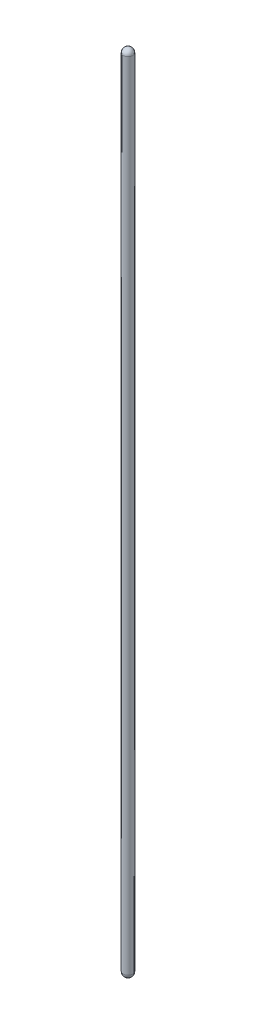
ISO-10303-21;
HEADER;
FILE_DESCRIPTION(('STEP AP214'),'2;1');
FILE_NAME('part.step','',(''),(''),'','','');
FILE_SCHEMA(('AUTOMOTIVE_DESIGN { 1 0 10303 214 1 1 1 1 }'));
ENDSEC;
DATA;
#1=APPLICATION_CONTEXT('core data for automotive mechanical design processes');
#2=APPLICATION_PROTOCOL_DEFINITION('international standard','automotive_design',2000,#1);
#3=PRODUCT_CONTEXT('',#1,'mechanical');
#4=PRODUCT('Part','Part','',(#3));
#5=PRODUCT_RELATED_PRODUCT_CATEGORY('part','',(#4));
#6=PRODUCT_DEFINITION_FORMATION('','',#4);
#7=PRODUCT_DEFINITION_CONTEXT('part definition',#1,'design');
#8=PRODUCT_DEFINITION('design','',#6,#7);
#9=PRODUCT_DEFINITION_SHAPE('','',#8);
#10=(LENGTH_UNIT() NAMED_UNIT(*) SI_UNIT(.MILLI.,.METRE.));
#11=(NAMED_UNIT(*) PLANE_ANGLE_UNIT() SI_UNIT($,.RADIAN.));
#12=(NAMED_UNIT(*) SI_UNIT($,.STERADIAN.) SOLID_ANGLE_UNIT());
#13=UNCERTAINTY_MEASURE_WITH_UNIT(LENGTH_MEASURE(1.E-05),#10,'distance_accuracy_value','');
#14=(GEOMETRIC_REPRESENTATION_CONTEXT(3) GLOBAL_UNCERTAINTY_ASSIGNED_CONTEXT((#13)) GLOBAL_UNIT_ASSIGNED_CONTEXT((#10,
#11,#12)) REPRESENTATION_CONTEXT('',''));
#15=CARTESIAN_POINT('',(0.,0.,0.));
#16=DIRECTION('',(0.,0.,1.));
#17=DIRECTION('',(1.,0.,0.));
#18=AXIS2_PLACEMENT_3D('',#15,#16,#17);
#19=CARTESIAN_POINT('',(0.,84.,0.));
#20=DIRECTION('',(0.,-1.,0.));
#21=DIRECTION('',(0.,0.,-1.));
#22=AXIS2_PLACEMENT_3D('',#19,#20,#21);
#23=CYLINDRICAL_SURFACE('',#22,0.5);
#24=CARTESIAN_POINT('',(0.,0.500000000000014,0.));
#25=DIRECTION('',(0.,-1.,0.));
#26=DIRECTION('',(0.,0.,-1.));
#27=AXIS2_PLACEMENT_3D('',#24,#25,#26);
#28=CIRCLE('',#27,0.5);
#29=CARTESIAN_POINT('',(0.,0.500000000000014,-0.5));
#30=VERTEX_POINT('',#29);
#31=EDGE_CURVE('E10',#30,#30,#28,.F.);
#32=ORIENTED_EDGE('',*,*,#31,.T.);
#33=EDGE_LOOP('',(#32));
#34=FACE_BOUND('',#33,.T.);
#35=CARTESIAN_POINT('',(0.,83.5,0.));
#36=DIRECTION('',(0.,-1.,0.));
#37=DIRECTION('',(0.,0.,-1.));
#38=AXIS2_PLACEMENT_3D('',#35,#36,#37);
#39=CIRCLE('',#38,0.5);
#40=CARTESIAN_POINT('',(0.,83.5,-0.5));
#41=VERTEX_POINT('',#40);
#42=EDGE_CURVE('E37',#41,#41,#39,.T.);
#43=ORIENTED_EDGE('',*,*,#42,.T.);
#44=EDGE_LOOP('',(#43));
#45=FACE_BOUND('',#44,.T.);
#46=ADVANCED_FACE('F30',(#34,#45),#23,.T.);
#47=CARTESIAN_POINT('',(0.,83.5,0.));
#48=DIRECTION('',(0.,1.,0.));
#49=DIRECTION('',(0.,0.,1.));
#50=AXIS2_PLACEMENT_3D('',#47,#48,#49);
#51=SPHERICAL_SURFACE('',#50,0.5);
#52=ORIENTED_EDGE('',*,*,#42,.F.);
#53=EDGE_LOOP('',(#52));
#54=FACE_BOUND('',#53,.T.);
#55=ADVANCED_FACE('F44',(#54),#51,.T.);
#56=CARTESIAN_POINT('',(0.,0.5,0.));
#57=DIRECTION('',(0.,1.,0.));
#58=DIRECTION('',(0.,0.,1.));
#59=AXIS2_PLACEMENT_3D('',#56,#57,#58);
#60=SPHERICAL_SURFACE('',#59,0.5);
#61=ORIENTED_EDGE('',*,*,#31,.F.);
#62=EDGE_LOOP('',(#61));
#63=FACE_BOUND('',#62,.T.);
#64=ADVANCED_FACE('F32',(#63),#60,.T.);
#65=CLOSED_SHELL('',(#46,#55,#64));
#66=MANIFOLD_SOLID_BREP('B2',#65);
#67=ADVANCED_BREP_SHAPE_REPRESENTATION('',(#18,#66),#14);
#68=SHAPE_DEFINITION_REPRESENTATION(#9,#67);
ENDSEC;
END-ISO-10303-21;
